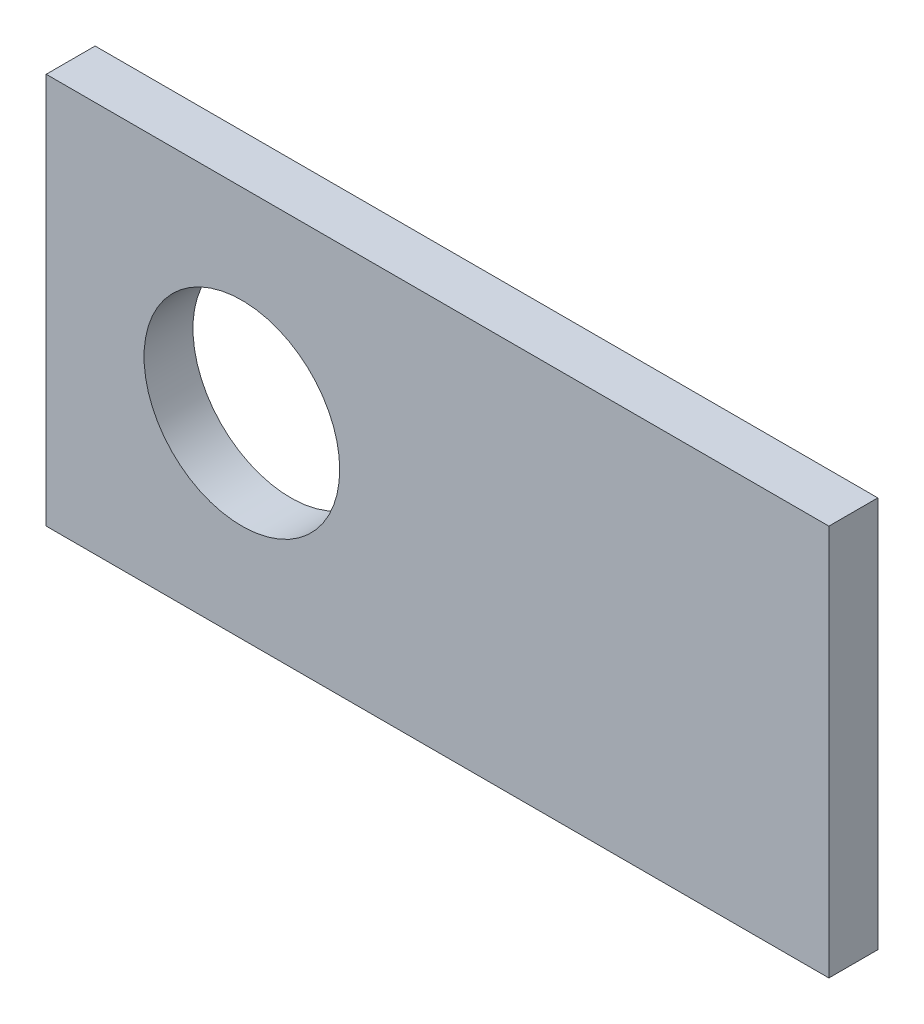
ISO-10303-21;
HEADER;
FILE_DESCRIPTION(('STEP AP214'),'2;1');
FILE_NAME('part.step','',(''),(''),'','','');
FILE_SCHEMA(('AUTOMOTIVE_DESIGN { 1 0 10303 214 1 1 1 1 }'));
ENDSEC;
DATA;
#1=APPLICATION_CONTEXT('core data for automotive mechanical design processes');
#2=APPLICATION_PROTOCOL_DEFINITION('international standard','automotive_design',2000,#1);
#3=PRODUCT_CONTEXT('',#1,'mechanical');
#4=PRODUCT('Part','Part','',(#3));
#5=PRODUCT_RELATED_PRODUCT_CATEGORY('part','',(#4));
#6=PRODUCT_DEFINITION_FORMATION('','',#4);
#7=PRODUCT_DEFINITION_CONTEXT('part definition',#1,'design');
#8=PRODUCT_DEFINITION('design','',#6,#7);
#9=PRODUCT_DEFINITION_SHAPE('','',#8);
#10=(LENGTH_UNIT() NAMED_UNIT(*) SI_UNIT(.MILLI.,.METRE.));
#11=(NAMED_UNIT(*) PLANE_ANGLE_UNIT() SI_UNIT($,.RADIAN.));
#12=(NAMED_UNIT(*) SI_UNIT($,.STERADIAN.) SOLID_ANGLE_UNIT());
#13=UNCERTAINTY_MEASURE_WITH_UNIT(LENGTH_MEASURE(1.E-05),#10,'distance_accuracy_value','');
#14=(GEOMETRIC_REPRESENTATION_CONTEXT(3) GLOBAL_UNCERTAINTY_ASSIGNED_CONTEXT((#13)) GLOBAL_UNIT_ASSIGNED_CONTEXT((#10,
#11,#12)) REPRESENTATION_CONTEXT('',''));
#15=CARTESIAN_POINT('',(0.,0.,0.));
#16=DIRECTION('',(0.,0.,1.));
#17=DIRECTION('',(1.,0.,0.));
#18=AXIS2_PLACEMENT_3D('',#15,#16,#17);
#19=CARTESIAN_POINT('',(0.,0.,3.175));
#20=DIRECTION('',(0.,0.,-1.));
#21=DIRECTION('',(-1.,0.,0.));
#22=AXIS2_PLACEMENT_3D('',#19,#20,#21);
#23=PLANE('',#22);
#24=DIRECTION('',(0.,-1.,0.));
#25=VECTOR('',#24,1.);
#26=CARTESIAN_POINT('',(0.,0.,3.175));
#27=LINE('',#26,#25);
#28=CARTESIAN_POINT('',(0.,25.4,3.175));
#29=VERTEX_POINT('',#28);
#30=CARTESIAN_POINT('',(0.,0.,3.175));
#31=VERTEX_POINT('',#30);
#32=EDGE_CURVE('E94',#29,#31,#27,.T.);
#33=ORIENTED_EDGE('',*,*,#32,.T.);
#34=DIRECTION('',(1.,0.,0.));
#35=VECTOR('',#34,1.);
#36=CARTESIAN_POINT('',(0.,0.,3.175));
#37=LINE('',#36,#35);
#38=CARTESIAN_POINT('',(50.8,0.,3.175));
#39=VERTEX_POINT('',#38);
#40=EDGE_CURVE('E89',#31,#39,#37,.T.);
#41=ORIENTED_EDGE('',*,*,#40,.T.);
#42=DIRECTION('',(0.,1.,0.));
#43=VECTOR('',#42,1.);
#44=CARTESIAN_POINT('',(50.8,0.,3.175));
#45=LINE('',#44,#43);
#46=CARTESIAN_POINT('',(50.8,25.4,3.175));
#47=VERTEX_POINT('',#46);
#48=EDGE_CURVE('E92',#39,#47,#45,.T.);
#49=ORIENTED_EDGE('',*,*,#48,.T.);
#50=DIRECTION('',(-1.,0.,0.));
#51=VECTOR('',#50,1.);
#52=CARTESIAN_POINT('',(0.,25.4,3.175));
#53=LINE('',#52,#51);
#54=EDGE_CURVE('E56',#47,#29,#53,.T.);
#55=ORIENTED_EDGE('',*,*,#54,.T.);
#56=EDGE_LOOP('',(#33,#41,#49,#55));
#57=FACE_BOUND('',#56,.T.);
#58=CARTESIAN_POINT('',(12.7,12.7,3.175));
#59=DIRECTION('',(0.,0.,1.));
#60=DIRECTION('',(1.,0.,0.));
#61=AXIS2_PLACEMENT_3D('',#58,#59,#60);
#62=CIRCLE('',#61,6.35000000000002);
#63=CARTESIAN_POINT('',(19.05,12.7,3.175));
#64=VERTEX_POINT('',#63);
#65=EDGE_CURVE('E114',#64,#64,#62,.T.);
#66=ORIENTED_EDGE('',*,*,#65,.F.);
#67=EDGE_LOOP('',(#66));
#68=FACE_BOUND('',#67,.T.);
#69=ADVANCED_FACE('F39',(#57,#68),#23,.F.);
#70=CARTESIAN_POINT('',(0.,0.,0.));
#71=DIRECTION('',(0.,0.,-1.));
#72=DIRECTION('',(-1.,0.,0.));
#73=AXIS2_PLACEMENT_3D('',#70,#71,#72);
#74=PLANE('',#73);
#75=DIRECTION('',(0.,-1.,0.));
#76=VECTOR('',#75,1.);
#77=CARTESIAN_POINT('',(0.,0.,0.));
#78=LINE('',#77,#76);
#79=CARTESIAN_POINT('',(0.,25.4,0.));
#80=VERTEX_POINT('',#79);
#81=CARTESIAN_POINT('',(0.,0.,0.));
#82=VERTEX_POINT('',#81);
#83=EDGE_CURVE('E111',#80,#82,#78,.T.);
#84=ORIENTED_EDGE('',*,*,#83,.F.);
#85=DIRECTION('',(-1.,0.,0.));
#86=VECTOR('',#85,1.);
#87=CARTESIAN_POINT('',(0.,25.4,0.));
#88=LINE('',#87,#86);
#89=CARTESIAN_POINT('',(50.8,25.4,0.));
#90=VERTEX_POINT('',#89);
#91=EDGE_CURVE('E82',#90,#80,#88,.T.);
#92=ORIENTED_EDGE('',*,*,#91,.F.);
#93=DIRECTION('',(0.,1.,0.));
#94=VECTOR('',#93,1.);
#95=CARTESIAN_POINT('',(50.8,0.,0.));
#96=LINE('',#95,#94);
#97=CARTESIAN_POINT('',(50.8,0.,0.));
#98=VERTEX_POINT('',#97);
#99=EDGE_CURVE('E76',#98,#90,#96,.T.);
#100=ORIENTED_EDGE('',*,*,#99,.F.);
#101=DIRECTION('',(1.,0.,0.));
#102=VECTOR('',#101,1.);
#103=CARTESIAN_POINT('',(0.,0.,0.));
#104=LINE('',#103,#102);
#105=EDGE_CURVE('E99',#82,#98,#104,.T.);
#106=ORIENTED_EDGE('',*,*,#105,.F.);
#107=EDGE_LOOP('',(#84,#92,#100,#106));
#108=FACE_BOUND('',#107,.T.);
#109=CARTESIAN_POINT('',(12.7,12.7,0.));
#110=DIRECTION('',(0.,0.,1.));
#111=DIRECTION('',(1.,0.,0.));
#112=AXIS2_PLACEMENT_3D('',#109,#110,#111);
#113=CIRCLE('',#112,6.35000000000002);
#114=CARTESIAN_POINT('',(19.05,12.7,0.));
#115=VERTEX_POINT('',#114);
#116=EDGE_CURVE('E128',#115,#115,#113,.T.);
#117=ORIENTED_EDGE('',*,*,#116,.T.);
#118=EDGE_LOOP('',(#117));
#119=FACE_BOUND('',#118,.T.);
#120=ADVANCED_FACE('F124',(#108,#119),#74,.T.);
#121=CARTESIAN_POINT('',(0.,0.,3.175));
#122=DIRECTION('',(1.,0.,0.));
#123=DIRECTION('',(0.,0.,-1.));
#124=AXIS2_PLACEMENT_3D('',#121,#122,#123);
#125=PLANE('',#124);
#126=ORIENTED_EDGE('',*,*,#83,.T.);
#127=DIRECTION('',(0.,0.,-1.));
#128=VECTOR('',#127,1.);
#129=CARTESIAN_POINT('',(0.,0.,3.175));
#130=LINE('',#129,#128);
#131=EDGE_CURVE('E11',#31,#82,#130,.T.);
#132=ORIENTED_EDGE('',*,*,#131,.F.);
#133=ORIENTED_EDGE('',*,*,#32,.F.);
#134=DIRECTION('',(0.,0.,-1.));
#135=VECTOR('',#134,1.);
#136=CARTESIAN_POINT('',(0.,25.4,3.175));
#137=LINE('',#136,#135);
#138=EDGE_CURVE('E107',#29,#80,#137,.T.);
#139=ORIENTED_EDGE('',*,*,#138,.T.);
#140=EDGE_LOOP('',(#126,#132,#133,#139));
#141=FACE_BOUND('',#140,.T.);
#142=ADVANCED_FACE('F41',(#141),#125,.F.);
#143=CARTESIAN_POINT('',(0.,0.,3.175));
#144=DIRECTION('',(0.,1.,0.));
#145=DIRECTION('',(0.,0.,1.));
#146=AXIS2_PLACEMENT_3D('',#143,#144,#145);
#147=PLANE('',#146);
#148=ORIENTED_EDGE('',*,*,#105,.T.);
#149=DIRECTION('',(0.,0.,-1.));
#150=VECTOR('',#149,1.);
#151=CARTESIAN_POINT('',(50.8,0.,3.175));
#152=LINE('',#151,#150);
#153=EDGE_CURVE('E48',#39,#98,#152,.T.);
#154=ORIENTED_EDGE('',*,*,#153,.F.);
#155=ORIENTED_EDGE('',*,*,#40,.F.);
#156=ORIENTED_EDGE('',*,*,#131,.T.);
#157=EDGE_LOOP('',(#148,#154,#155,#156));
#158=FACE_BOUND('',#157,.T.);
#159=ADVANCED_FACE('F98',(#158),#147,.F.);
#160=CARTESIAN_POINT('',(50.8,0.,3.175));
#161=DIRECTION('',(-1.,0.,0.));
#162=DIRECTION('',(0.,0.,1.));
#163=AXIS2_PLACEMENT_3D('',#160,#161,#162);
#164=PLANE('',#163);
#165=ORIENTED_EDGE('',*,*,#99,.T.);
#166=DIRECTION('',(0.,0.,-1.));
#167=VECTOR('',#166,1.);
#168=CARTESIAN_POINT('',(50.8,25.4,3.175));
#169=LINE('',#168,#167);
#170=EDGE_CURVE('E101',#47,#90,#169,.T.);
#171=ORIENTED_EDGE('',*,*,#170,.F.);
#172=ORIENTED_EDGE('',*,*,#48,.F.);
#173=ORIENTED_EDGE('',*,*,#153,.T.);
#174=EDGE_LOOP('',(#165,#171,#172,#173));
#175=FACE_BOUND('',#174,.T.);
#176=ADVANCED_FACE('F102',(#175),#164,.F.);
#177=CARTESIAN_POINT('',(0.,25.4,3.175));
#178=DIRECTION('',(0.,-1.,0.));
#179=DIRECTION('',(0.,0.,-1.));
#180=AXIS2_PLACEMENT_3D('',#177,#178,#179);
#181=PLANE('',#180);
#182=ORIENTED_EDGE('',*,*,#91,.T.);
#183=ORIENTED_EDGE('',*,*,#138,.F.);
#184=ORIENTED_EDGE('',*,*,#54,.F.);
#185=ORIENTED_EDGE('',*,*,#170,.T.);
#186=EDGE_LOOP('',(#182,#183,#184,#185));
#187=FACE_BOUND('',#186,.T.);
#188=ADVANCED_FACE('F121',(#187),#181,.F.);
#189=CARTESIAN_POINT('',(12.7,12.7,3.175));
#190=DIRECTION('',(0.,0.,-1.));
#191=DIRECTION('',(-1.,0.,0.));
#192=AXIS2_PLACEMENT_3D('',#189,#190,#191);
#193=CYLINDRICAL_SURFACE('',#192,6.35000000000002);
#194=ORIENTED_EDGE('',*,*,#65,.T.);
#195=EDGE_LOOP('',(#194));
#196=FACE_BOUND('',#195,.T.);
#197=ORIENTED_EDGE('',*,*,#116,.F.);
#198=EDGE_LOOP('',(#197));
#199=FACE_BOUND('',#198,.T.);
#200=ADVANCED_FACE('F136',(#196,#199),#193,.F.);
#201=CLOSED_SHELL('',(#69,#120,#142,#159,#176,#188,#200));
#202=MANIFOLD_SOLID_BREP('B2',#201);
#203=ADVANCED_BREP_SHAPE_REPRESENTATION('',(#18,#202),#14);
#204=SHAPE_DEFINITION_REPRESENTATION(#9,#203);
ENDSEC;
END-ISO-10303-21;
